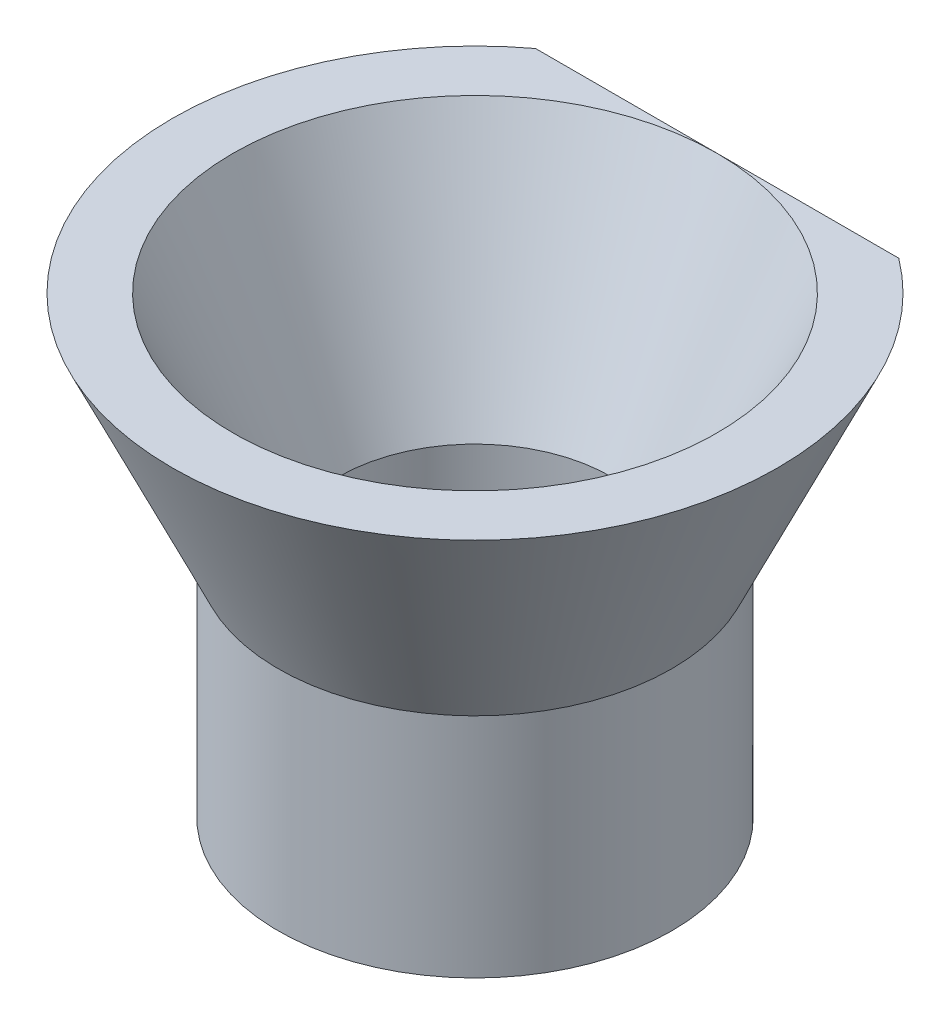
ISO-10303-21;
HEADER;
FILE_DESCRIPTION(('STEP AP214'),'2;1');
FILE_NAME('part.step','',(''),(''),'','','');
FILE_SCHEMA(('AUTOMOTIVE_DESIGN { 1 0 10303 214 1 1 1 1 }'));
ENDSEC;
DATA;
#1=APPLICATION_CONTEXT('core data for automotive mechanical design processes');
#2=APPLICATION_PROTOCOL_DEFINITION('international standard','automotive_design',2000,#1);
#3=PRODUCT_CONTEXT('',#1,'mechanical');
#4=PRODUCT('Part','Part','',(#3));
#5=PRODUCT_RELATED_PRODUCT_CATEGORY('part','',(#4));
#6=PRODUCT_DEFINITION_FORMATION('','',#4);
#7=PRODUCT_DEFINITION_CONTEXT('part definition',#1,'design');
#8=PRODUCT_DEFINITION('design','',#6,#7);
#9=PRODUCT_DEFINITION_SHAPE('','',#8);
#10=(LENGTH_UNIT() NAMED_UNIT(*) SI_UNIT(.MILLI.,.METRE.));
#11=(NAMED_UNIT(*) PLANE_ANGLE_UNIT() SI_UNIT($,.RADIAN.));
#12=(NAMED_UNIT(*) SI_UNIT($,.STERADIAN.) SOLID_ANGLE_UNIT());
#13=UNCERTAINTY_MEASURE_WITH_UNIT(LENGTH_MEASURE(1.E-05),#10,'distance_accuracy_value','');
#14=(GEOMETRIC_REPRESENTATION_CONTEXT(3) GLOBAL_UNCERTAINTY_ASSIGNED_CONTEXT((#13)) GLOBAL_UNIT_ASSIGNED_CONTEXT((#10,
#11,#12)) REPRESENTATION_CONTEXT('',''));
#15=CARTESIAN_POINT('',(0.,0.,0.));
#16=DIRECTION('',(0.,0.,1.));
#17=DIRECTION('',(1.,0.,0.));
#18=AXIS2_PLACEMENT_3D('',#15,#16,#17);
#19=CARTESIAN_POINT('',(0.,7.5,0.));
#20=DIRECTION('',(0.,1.,0.));
#21=DIRECTION('',(-1.,0.,0.));
#22=AXIS2_PLACEMENT_3D('',#19,#20,#21);
#23=CONICAL_SURFACE('',#22,10.,0.436627159813541);
#24=CARTESIAN_POINT('',(-12.6552971120007,18.1539823603802,-8.));
#25=CARTESIAN_POINT('',(-12.3923644393167,17.6778202261493,-8.));
#26=CARTESIAN_POINT('',(-12.1277057210002,17.2026010770708,-8.));
#27=CARTESIAN_POINT('',(-11.5940586841496,16.2545141440704,-8.));
#28=CARTESIAN_POINT('',(-11.3250697649448,15.781646698487,-8.));
#29=CARTESIAN_POINT('',(-10.7803466143219,14.836065048402,-8.));
#30=CARTESIAN_POINT('',(-10.5045818291893,14.3633684020067,-8.));
#31=CARTESIAN_POINT('',(-9.94668648472595,13.421792884282,-8.));
#32=CARTESIAN_POINT('',(-9.66455643092106,12.952913713768,-8.));
#33=CARTESIAN_POINT('',(-9.06874933332751,11.9815455361093,-8.));
#34=CARTESIAN_POINT('',(-8.75438921396223,11.479472994199,-8.));
#35=CARTESIAN_POINT('',(-8.27369084870163,10.7321565115626,-8.));
#36=CARTESIAN_POINT('',(-8.11190773287192,10.4839810761607,-8.));
#37=CARTESIAN_POINT('',(-7.78481728120303,9.98996630319231,-8.));
#38=CARTESIAN_POINT('',(-7.61951002023271,9.74412691615765,-8.));
#39=CARTESIAN_POINT('',(-7.28524361843176,9.25590100342951,-8.));
#40=CARTESIAN_POINT('',(-7.11629539430184,9.01350701695728,-8.));
#41=CARTESIAN_POINT('',(-6.77362080705701,8.5321277801797,-8.));
#42=CARTESIAN_POINT('',(-6.5998946652613,8.29314237276077,-8.));
#43=CARTESIAN_POINT('',(-6.246849308135,7.81949495636962,-8.));
#44=CARTESIAN_POINT('',(-6.06753263061281,7.58483106045039,-8.));
#45=CARTESIAN_POINT('',(-5.70212928606453,7.12085164312078,-8.));
#46=CARTESIAN_POINT('',(-5.51604352815725,6.89153541023383,-8.));
#47=CARTESIAN_POINT('',(-5.22922358719642,6.55094793446307,-8.));
#48=CARTESIAN_POINT('',(-5.13153980929148,6.43710634896692,-8.));
#49=CARTESIAN_POINT('',(-4.93381096665052,6.21149223709987,-8.));
#50=CARTESIAN_POINT('',(-4.83376586079655,6.09971974681879,-8.));
#51=CARTESIAN_POINT('',(-4.52958474417659,5.76783710270117,-8.));
#52=CARTESIAN_POINT('',(-4.32150692867904,5.55128656790299,-8.));
#53=CARTESIAN_POINT('',(-3.89441214251301,5.13330458793783,-8.));
#54=CARTESIAN_POINT('',(-3.67551625291563,4.93175025651336,-8.));
#55=CARTESIAN_POINT('',(-3.22211022626449,4.54711060610251,-8.));
#56=CARTESIAN_POINT('',(-2.98761841888705,4.36400422070256,-8.));
#57=CARTESIAN_POINT('',(-2.63697453477353,4.12028153705948,-8.));
#58=CARTESIAN_POINT('',(-2.52844690154139,4.04869819789772,-8.));
#59=CARTESIAN_POINT('',(-2.30757154551727,3.91175003539844,-8.));
#60=CARTESIAN_POINT('',(-2.19522397841807,3.84638495902853,-8.));
#61=CARTESIAN_POINT('',(-1.85206939302991,3.66130643151608,-8.));
#62=CARTESIAN_POINT('',(-1.61500766935271,3.55250696778099,-8.));
#63=CARTESIAN_POINT('',(-1.24646659127967,3.41913355097731,-8.));
#64=CARTESIAN_POINT('',(-1.1203741293078,3.37944802585946,-8.));
#65=CARTESIAN_POINT('',(-0.865049547239094,3.31208200125535,-8.));
#66=CARTESIAN_POINT('',(-0.735819557435812,3.28439358419474,-8.));
#67=CARTESIAN_POINT('',(-0.475356278228661,3.24227057027495,-8.));
#68=CARTESIAN_POINT('',(-0.34412557477638,3.22782013207144,-8.));
#69=CARTESIAN_POINT('',(-0.0808735617015832,3.21284453845404,-8.));
#70=CARTESIAN_POINT('',(0.0511476250438061,3.212317272212,-8.));
#71=CARTESIAN_POINT('',(0.295158216363457,3.22425938534873,-8.));
#72=CARTESIAN_POINT('',(0.407244758598836,3.23483329030389,-8.));
#73=CARTESIAN_POINT('',(0.630082350921373,3.26571933085182,-8.));
#74=CARTESIAN_POINT('',(0.740832890301274,3.28603507658305,-8.));
#75=CARTESIAN_POINT('',(1.07000379697113,3.36064059893137,-8.));
#76=CARTESIAN_POINT('',(1.28542195062323,3.42859324508665,-8.));
#77=CARTESIAN_POINT('',(1.65371382361194,3.57349587970265,-8.));
#78=CARTESIAN_POINT('',(1.80912802686718,3.64430953075353,-8.));
#79=CARTESIAN_POINT('',(2.11316000721696,3.7994342515247,-8.));
#80=CARTESIAN_POINT('',(2.26177361290776,3.88375346641071,-8.));
#81=CARTESIAN_POINT('',(2.55280210108162,4.06342767950535,-8.));
#82=CARTESIAN_POINT('',(2.69519365522175,4.15881999899511,-8.));
#83=CARTESIAN_POINT('',(2.97374684949427,4.35816998004392,-8.));
#84=CARTESIAN_POINT('',(3.10990995982352,4.46212560387612,-8.));
#85=CARTESIAN_POINT('',(3.44219516751004,4.7296314856346,-8.));
#86=CARTESIAN_POINT('',(3.63492850725456,4.89737966877084,-8.));
#87=CARTESIAN_POINT('',(4.01015189472256,5.2440360458296,-8.));
#88=CARTESIAN_POINT('',(4.19263579259542,5.42295080681836,-8.));
#89=CARTESIAN_POINT('',(4.54938225400627,5.78948004028901,-8.));
#90=CARTESIAN_POINT('',(4.72362681562941,5.97711193331357,-8.));
#91=CARTESIAN_POINT('',(5.06488108168478,6.35873615612567,-8.));
#92=CARTESIAN_POINT('',(5.23189229378873,6.55272714551103,-8.));
#93=CARTESIAN_POINT('',(5.56189679656611,6.94815443057646,-8.));
#94=CARTESIAN_POINT('',(5.72481512962584,7.14965304318517,-8.));
#95=CARTESIAN_POINT('',(6.04542688410297,7.55676625302041,-8.));
#96=CARTESIAN_POINT('',(6.20312006810114,7.76238103659755,-8.));
#97=CARTESIAN_POINT('',(6.51383489475928,8.1766674150526,-8.));
#98=CARTESIAN_POINT('',(6.66686257416741,8.3853344935551,-8.));
#99=CARTESIAN_POINT('',(6.96908415908321,8.80540754224324,-8.));
#100=CARTESIAN_POINT('',(7.11827822291518,9.01681339877605,-8.));
#101=CARTESIAN_POINT('',(7.44554517820075,9.48830077846354,-8.));
#102=CARTESIAN_POINT('',(7.6228163401816,9.74893830742552,-8.));
#103=CARTESIAN_POINT('',(7.97318644142663,10.2730061542769,-8.));
#104=CARTESIAN_POINT('',(8.1462852558512,10.5364365553924,-8.));
#105=CARTESIAN_POINT('',(8.66028713064252,11.3302434503358,-8.));
#106=CARTESIAN_POINT('',(8.99585457289881,11.8640758268823,-8.));
#107=CARTESIAN_POINT('',(9.65645012798831,12.9385297082297,-8.));
#108=CARTESIAN_POINT('',(9.98147314786024,13.4791543238229,-8.));
#109=CARTESIAN_POINT('',(10.6232221005083,14.5653164470215,-8.));
#110=CARTESIAN_POINT('',(10.9399478004413,15.1108540919226,-8.));
#111=CARTESIAN_POINT('',(11.5676145516638,16.2070860035844,-8.));
#112=CARTESIAN_POINT('',(11.8785387918571,16.7577898726076,-8.));
#113=CARTESIAN_POINT('',(12.4950462395027,17.8621848181529,-8.));
#114=CARTESIAN_POINT('',(12.8006293721546,18.4158759363687,-8.));
#115=CARTESIAN_POINT('',(13.4073190808889,19.5254872491561,-8.));
#116=CARTESIAN_POINT('',(13.7084269688018,20.0814067273401,-8.));
#117=CARTESIAN_POINT('',(14.3069926152827,21.1952072334252,-8.));
#118=CARTESIAN_POINT('',(14.6044503632818,21.7530882669999,-8.));
#119=CARTESIAN_POINT('',(15.4250432178884,23.3023084251397,-8.));
#120=CARTESIAN_POINT('',(15.9449000038019,24.2953838451407,-8.));
#121=CARTESIAN_POINT('',(16.9774121636473,26.2853719960714,-8.));
#122=CARTESIAN_POINT('',(17.4900669064808,27.2822850536526,-8.));
#123=CARTESIAN_POINT('',(18.5073894095573,29.2743722897777,-8.));
#124=CARTESIAN_POINT('',(19.0120831283978,30.2695332210264,-8.));
#125=CARTESIAN_POINT('',(19.7657733597909,31.7638946660356,-8.));
#126=CARTESIAN_POINT('',(20.0164316768606,32.2622583531111,-8.));
#127=CARTESIAN_POINT('',(20.5167489014191,33.2594861637339,-8.));
#128=CARTESIAN_POINT('',(20.7664078105422,33.758350286461,-8.));
#129=CARTESIAN_POINT('',(21.0156214969726,34.2574367983504,-8.));
#130=B_SPLINE_CURVE_WITH_KNOTS('',3,(#24,#25,#26,#27,#28,#29,#30,#31,#32,#33,#34,#35,#36,#37,
#38,#39,#40,#41,#42,#43,#44,#45,#46,#47,#48,#49,#50,#51,#52,#53,#54,#55,#56,#57,#58,#59,#60,#61,
#62,#63,#64,#65,#66,#67,#68,#69,#70,#71,#72,#73,#74,#75,#76,#77,#78,#79,#80,#81,#82,#83,#84,#85,
#86,#87,#88,#89,#90,#91,#92,#93,#94,#95,#96,#97,#98,#99,#100,#101,#102,#103,#104,#105,#106,#107,
#108,#109,#110,#111,#112,#113,#114,#115,#116,#117,#118,#119,#120,#121,#122,#123,#124,#125,#126,
#127,#128,#129),.UNSPECIFIED.,.F.,.F.,(4,2,2,2,2,2,2,2,2,2,2,2,2,2,2,2,2,2,2,2,2,2,2,2,2,2,2,2,
2,2,2,2,2,2,2,2,2,2,2,2,2,2,2,2,2,2,2,2,2,2,2,2,4),(0.,1.6318108223712,3.26384998861668,
4.90557310822145,6.54716629896667,8.32411465042856,9.2128448868446,10.1015562613662,
10.9878971829332,11.8741971169858,12.7601004135887,13.6458851654164,14.0958754443575,
14.5458735647947,15.4463567314697,16.3383834062008,17.2293796126063,17.6192157600344,
18.0090360375311,18.7881517781094,19.1842521084263,19.5800906299511,19.975454846691,
20.3707591237337,20.7080656836243,21.0454973395406,21.7201278027608,22.2318297173509,
22.7438414079747,23.2576318561756,23.7713003938661,24.5371960722073,25.3035464974472,
26.071500490203,26.839293637689,27.6165561385421,28.39385390819,29.170099109963,
29.9463122019282,30.8918901758328,31.8374964070731,33.7289264119333,35.6212567738711,
37.5136401824772,39.4108493562972,41.3080850786766,43.2047532361539,45.1014268840854,
48.4641263045672,51.8271185754132,55.1745727396162,56.8481201125069,58.5216647474398),.UNSPECIFIED.);
#131=CARTESIAN_POINT('',(6.,7.5,-8.));
#132=VERTEX_POINT('',#131);
#133=CARTESIAN_POINT('',(-6.,7.5,-8.));
#134=VERTEX_POINT('',#133);
#135=EDGE_CURVE('E51',#132,#134,#130,.F.);
#136=ORIENTED_EDGE('',*,*,#135,.F.);
#137=CARTESIAN_POINT('',(0.,7.5,0.));
#138=DIRECTION('',(0.,1.,0.));
#139=DIRECTION('',(-1.,0.,0.));
#140=AXIS2_PLACEMENT_3D('',#137,#138,#139);
#141=CIRCLE('',#140,10.);
#142=EDGE_CURVE('E61',#134,#132,#141,.T.);
#143=ORIENTED_EDGE('',*,*,#142,.F.);
#144=EDGE_LOOP('',(#136,#143));
#145=FACE_BOUND('',#144,.T.);
#146=CARTESIAN_POINT('',(0.,0.,0.));
#147=DIRECTION('',(0.,-1.,0.));
#148=DIRECTION('',(1.,0.,0.));
#149=AXIS2_PLACEMENT_3D('',#146,#147,#148);
#150=CIRCLE('',#149,6.5);
#151=CARTESIAN_POINT('',(6.5,0.,0.));
#152=VERTEX_POINT('',#151);
#153=EDGE_CURVE('E70',#152,#152,#150,.T.);
#154=ORIENTED_EDGE('',*,*,#153,.F.);
#155=EDGE_LOOP('',(#154));
#156=FACE_BOUND('',#155,.T.);
#157=ADVANCED_FACE('F33',(#145,#156),#23,.T.);
#158=CARTESIAN_POINT('',(0.,0.,0.));
#159=DIRECTION('',(0.,1.,0.));
#160=DIRECTION('',(-1.,0.,0.));
#161=AXIS2_PLACEMENT_3D('',#158,#159,#160);
#162=CONICAL_SURFACE('',#161,4.5,0.436627159813541);
#163=CARTESIAN_POINT('',(0.,7.5,0.));
#164=DIRECTION('',(0.,1.,0.));
#165=DIRECTION('',(-1.,0.,0.));
#166=AXIS2_PLACEMENT_3D('',#163,#164,#165);
#167=CIRCLE('',#166,8.);
#168=CARTESIAN_POINT('',(0.,7.5,-8.));
#169=VERTEX_POINT('',#168);
#170=EDGE_CURVE('E63',#169,#169,#167,.T.);
#171=ORIENTED_EDGE('',*,*,#170,.T.);
#172=EDGE_LOOP('',(#171));
#173=FACE_BOUND('',#172,.T.);
#174=CARTESIAN_POINT('',(0.,0.,0.));
#175=DIRECTION('',(0.,1.,0.));
#176=DIRECTION('',(-1.,0.,0.));
#177=AXIS2_PLACEMENT_3D('',#174,#175,#176);
#178=CIRCLE('',#177,4.5);
#179=CARTESIAN_POINT('',(-4.5,0.,0.));
#180=VERTEX_POINT('',#179);
#181=EDGE_CURVE('E67',#180,#180,#178,.T.);
#182=ORIENTED_EDGE('',*,*,#181,.F.);
#183=EDGE_LOOP('',(#182));
#184=FACE_BOUND('',#183,.T.);
#185=ADVANCED_FACE('F78',(#173,#184),#162,.F.);
#186=CARTESIAN_POINT('',(-8.,7.5,0.));
#187=DIRECTION('',(0.,1.,0.));
#188=DIRECTION('',(-1.,0.,0.));
#189=AXIS2_PLACEMENT_3D('',#186,#187,#188);
#190=PLANE('',#189);
#191=DIRECTION('',(1.,0.,0.));
#192=VECTOR('',#191,1.);
#193=CARTESIAN_POINT('',(-8.,7.5,-8.));
#194=LINE('',#193,#192);
#195=EDGE_CURVE('E11',#134,#169,#194,.T.);
#196=ORIENTED_EDGE('',*,*,#195,.F.);
#197=ORIENTED_EDGE('',*,*,#142,.T.);
#198=EDGE_CURVE('E37',#169,#132,#194,.T.);
#199=ORIENTED_EDGE('',*,*,#198,.F.);
#200=ORIENTED_EDGE('',*,*,#170,.F.);
#201=EDGE_LOOP('',(#196,#197,#199,#200));
#202=FACE_BOUND('',#201,.T.);
#203=ADVANCED_FACE('F60',(#202),#190,.T.);
#204=CARTESIAN_POINT('',(0.,-7.5,0.));
#205=DIRECTION('',(0.,-1.,0.));
#206=DIRECTION('',(1.,0.,0.));
#207=AXIS2_PLACEMENT_3D('',#204,#205,#206);
#208=PLANE('',#207);
#209=CARTESIAN_POINT('',(0.,-7.5,0.));
#210=DIRECTION('',(0.,-1.,0.));
#211=DIRECTION('',(1.,0.,0.));
#212=AXIS2_PLACEMENT_3D('',#209,#210,#211);
#213=CIRCLE('',#212,6.5);
#214=CARTESIAN_POINT('',(6.5,-7.5,0.));
#215=VERTEX_POINT('',#214);
#216=EDGE_CURVE('E65',#215,#215,#213,.T.);
#217=ORIENTED_EDGE('',*,*,#216,.T.);
#218=EDGE_LOOP('',(#217));
#219=FACE_BOUND('',#218,.T.);
#220=CARTESIAN_POINT('',(0.,-7.5,0.));
#221=DIRECTION('',(0.,-1.,0.));
#222=DIRECTION('',(1.,0.,0.));
#223=AXIS2_PLACEMENT_3D('',#220,#221,#222);
#224=CIRCLE('',#223,4.5);
#225=CARTESIAN_POINT('',(4.5,-7.5,0.));
#226=VERTEX_POINT('',#225);
#227=EDGE_CURVE('E56',#226,#226,#224,.T.);
#228=ORIENTED_EDGE('',*,*,#227,.F.);
#229=EDGE_LOOP('',(#228));
#230=FACE_BOUND('',#229,.T.);
#231=ADVANCED_FACE('F85',(#219,#230),#208,.T.);
#232=CARTESIAN_POINT('',(0.,-7.5,0.));
#233=DIRECTION('',(0.,1.,0.));
#234=DIRECTION('',(-1.,0.,0.));
#235=AXIS2_PLACEMENT_3D('',#232,#233,#234);
#236=CYLINDRICAL_SURFACE('',#235,6.5);
#237=ORIENTED_EDGE('',*,*,#216,.F.);
#238=EDGE_LOOP('',(#237));
#239=FACE_BOUND('',#238,.T.);
#240=ORIENTED_EDGE('',*,*,#153,.T.);
#241=EDGE_LOOP('',(#240));
#242=FACE_BOUND('',#241,.T.);
#243=ADVANCED_FACE('F88',(#239,#242),#236,.T.);
#244=CARTESIAN_POINT('',(0.,-7.5,0.));
#245=DIRECTION('',(0.,1.,0.));
#246=DIRECTION('',(-1.,0.,0.));
#247=AXIS2_PLACEMENT_3D('',#244,#245,#246);
#248=CYLINDRICAL_SURFACE('',#247,4.5);
#249=ORIENTED_EDGE('',*,*,#227,.T.);
#250=EDGE_LOOP('',(#249));
#251=FACE_BOUND('',#250,.T.);
#252=ORIENTED_EDGE('',*,*,#181,.T.);
#253=EDGE_LOOP('',(#252));
#254=FACE_BOUND('',#253,.T.);
#255=ADVANCED_FACE('F76',(#251,#254),#248,.F.);
#256=CARTESIAN_POINT('',(-9.02775382563607,0.,-8.));
#257=DIRECTION('',(0.,0.,1.));
#258=DIRECTION('',(1.,0.,0.));
#259=AXIS2_PLACEMENT_3D('',#256,#257,#258);
#260=PLANE('',#259);
#261=ORIENTED_EDGE('',*,*,#135,.T.);
#262=ORIENTED_EDGE('',*,*,#195,.T.);
#263=ORIENTED_EDGE('',*,*,#198,.T.);
#264=EDGE_LOOP('',(#261,#262,#263));
#265=FACE_BOUND('',#264,.T.);
#266=ADVANCED_FACE('F52',(#265),#260,.F.);
#267=CLOSED_SHELL('',(#157,#185,#203,#231,#243,#255,#266));
#268=MANIFOLD_SOLID_BREP('B2',#267);
#269=ADVANCED_BREP_SHAPE_REPRESENTATION('',(#18,#268),#14);
#270=SHAPE_DEFINITION_REPRESENTATION(#9,#269);
ENDSEC;
END-ISO-10303-21;
